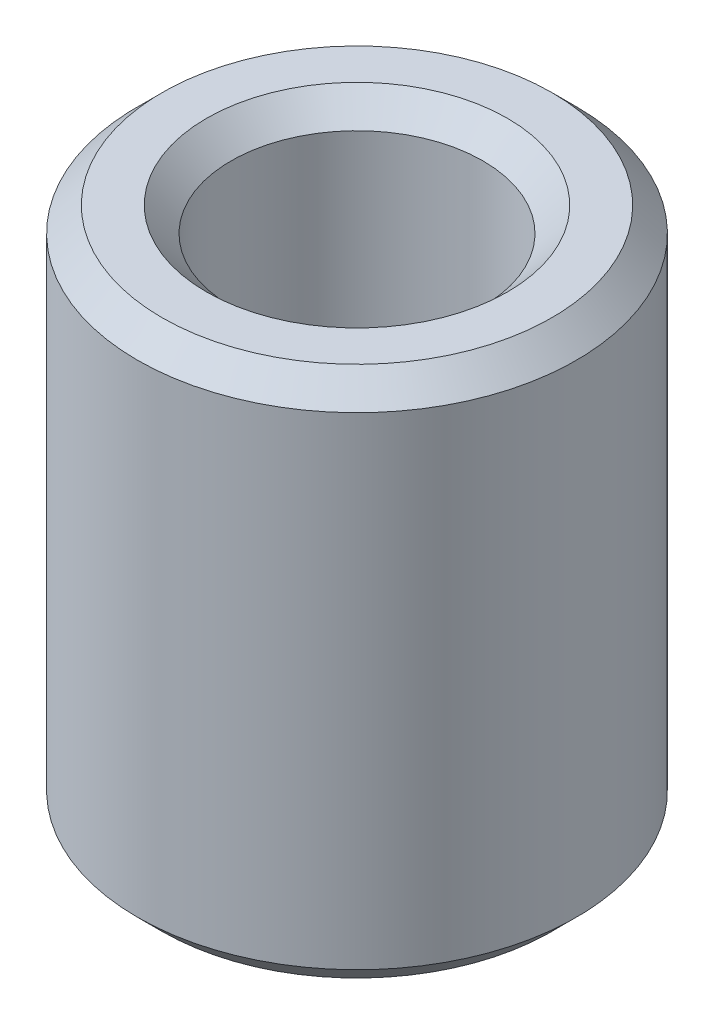
ISO-10303-21;
HEADER;
FILE_DESCRIPTION(('STEP AP214'),'2;1');
FILE_NAME('part.step','',(''),(''),'','','');
FILE_SCHEMA(('AUTOMOTIVE_DESIGN { 1 0 10303 214 1 1 1 1 }'));
ENDSEC;
DATA;
#1=APPLICATION_CONTEXT('core data for automotive mechanical design processes');
#2=APPLICATION_PROTOCOL_DEFINITION('international standard','automotive_design',2000,#1);
#3=PRODUCT_CONTEXT('',#1,'mechanical');
#4=PRODUCT('Part','Part','',(#3));
#5=PRODUCT_RELATED_PRODUCT_CATEGORY('part','',(#4));
#6=PRODUCT_DEFINITION_FORMATION('','',#4);
#7=PRODUCT_DEFINITION_CONTEXT('part definition',#1,'design');
#8=PRODUCT_DEFINITION('design','',#6,#7);
#9=PRODUCT_DEFINITION_SHAPE('','',#8);
#10=(LENGTH_UNIT() NAMED_UNIT(*) SI_UNIT(.MILLI.,.METRE.));
#11=(NAMED_UNIT(*) PLANE_ANGLE_UNIT() SI_UNIT($,.RADIAN.));
#12=(NAMED_UNIT(*) SI_UNIT($,.STERADIAN.) SOLID_ANGLE_UNIT());
#13=UNCERTAINTY_MEASURE_WITH_UNIT(LENGTH_MEASURE(1.E-05),#10,'distance_accuracy_value','');
#14=(GEOMETRIC_REPRESENTATION_CONTEXT(3) GLOBAL_UNCERTAINTY_ASSIGNED_CONTEXT((#13)) GLOBAL_UNIT_ASSIGNED_CONTEXT((#10,
#11,#12)) REPRESENTATION_CONTEXT('',''));
#15=CARTESIAN_POINT('',(0.,0.,0.));
#16=DIRECTION('',(0.,0.,1.));
#17=DIRECTION('',(1.,0.,0.));
#18=AXIS2_PLACEMENT_3D('',#15,#16,#17);
#19=CARTESIAN_POINT('',(0.,48.4298238941089,0.));
#20=DIRECTION('',(0.,-1.,0.));
#21=DIRECTION('',(0.,0.,-1.));
#22=AXIS2_PLACEMENT_3D('',#19,#20,#21);
#23=CYLINDRICAL_SURFACE('',#22,20.);
#24=CARTESIAN_POINT('',(0.,2.23736414351285,0.));
#25=DIRECTION('',(0.,1.,0.));
#26=DIRECTION('',(0.,0.,1.));
#27=AXIS2_PLACEMENT_3D('',#24,#25,#26);
#28=CIRCLE('',#27,20.);
#29=CARTESIAN_POINT('',(0.,2.23736414351285,-20.));
#30=VERTEX_POINT('',#29);
#31=EDGE_CURVE('E10',#30,#30,#28,.T.);
#32=CARTESIAN_POINT('',(0.,46.1924597505961,0.));
#33=DIRECTION('',(0.,1.,0.));
#34=DIRECTION('',(0.,0.,1.));
#35=AXIS2_PLACEMENT_3D('',#32,#33,#34);
#36=CIRCLE('',#35,20.);
#37=CARTESIAN_POINT('',(0.,46.1924597505961,-20.));
#38=VERTEX_POINT('',#37);
#39=EDGE_CURVE('E50',#38,#38,#36,.F.);
#40=CARTESIAN_POINT('',(0.,2.23736414351285,-20.));
#41=CARTESIAN_POINT('',(0.,2.6952297227533,-20.));
#42=CARTESIAN_POINT('',(0.,3.15309530199375,-20.));
#43=CARTESIAN_POINT('',(0.,4.06882646047465,-20.));
#44=CARTESIAN_POINT('',(0.,4.5266920397151,-20.));
#45=CARTESIAN_POINT('',(0.,5.442423198196,-20.));
#46=CARTESIAN_POINT('',(0.,5.90028877743645,-20.));
#47=CARTESIAN_POINT('',(0.,6.81601993591735,-20.));
#48=CARTESIAN_POINT('',(0.,7.2738855151578,-20.));
#49=CARTESIAN_POINT('',(0.,8.18961667363871,-20.));
#50=CARTESIAN_POINT('',(0.,8.64748225287916,-20.));
#51=CARTESIAN_POINT('',(0.,9.56321341136006,-20.));
#52=CARTESIAN_POINT('',(0.,10.0210789906005,-20.));
#53=CARTESIAN_POINT('',(0.,10.9368101490814,-20.));
#54=CARTESIAN_POINT('',(0.,11.3946757283219,-20.));
#55=CARTESIAN_POINT('',(0.,12.3104068868028,-20.));
#56=CARTESIAN_POINT('',(0.,12.7682724660432,-20.));
#57=CARTESIAN_POINT('',(0.,13.6840036245241,-20.));
#58=CARTESIAN_POINT('',(0.,14.1418692037646,-20.));
#59=CARTESIAN_POINT('',(0.,15.0576003622455,-20.));
#60=CARTESIAN_POINT('',(0.,15.5154659414859,-20.));
#61=CARTESIAN_POINT('',(0.,16.4311970999668,-20.));
#62=CARTESIAN_POINT('',(0.,16.8890626792073,-20.));
#63=CARTESIAN_POINT('',(0.,17.8047938376882,-20.));
#64=CARTESIAN_POINT('',(0.,18.2626594169286,-20.));
#65=CARTESIAN_POINT('',(0.,19.1783905754095,-20.));
#66=CARTESIAN_POINT('',(0.,19.63625615465,-20.));
#67=CARTESIAN_POINT('',(0.,20.5519873131309,-20.));
#68=CARTESIAN_POINT('',(0.,21.0098528923713,-20.));
#69=CARTESIAN_POINT('',(0.,21.9255840508522,-20.));
#70=CARTESIAN_POINT('',(0.,22.3834496300927,-20.));
#71=CARTESIAN_POINT('',(0.,23.2991807885736,-20.));
#72=CARTESIAN_POINT('',(0.,23.757046367814,-20.));
#73=CARTESIAN_POINT('',(0.,24.6727775262949,-20.));
#74=CARTESIAN_POINT('',(0.,25.1306431055354,-20.));
#75=CARTESIAN_POINT('',(0.,26.0463742640163,-20.));
#76=CARTESIAN_POINT('',(0.,26.5042398432567,-20.));
#77=CARTESIAN_POINT('',(0.,27.4199710017376,-20.));
#78=CARTESIAN_POINT('',(0.,27.8778365809781,-20.));
#79=CARTESIAN_POINT('',(0.,28.793567739459,-20.));
#80=CARTESIAN_POINT('',(0.,29.2514333186994,-20.));
#81=CARTESIAN_POINT('',(0.,30.1671644771803,-20.));
#82=CARTESIAN_POINT('',(0.,30.6250300564208,-20.));
#83=CARTESIAN_POINT('',(0.,31.5407612149017,-20.));
#84=CARTESIAN_POINT('',(0.,31.9986267941421,-20.));
#85=CARTESIAN_POINT('',(0.,32.914357952623,-20.));
#86=CARTESIAN_POINT('',(0.,33.3722235318635,-20.));
#87=CARTESIAN_POINT('',(0.,34.2879546903444,-20.));
#88=CARTESIAN_POINT('',(0.,34.7458202695848,-20.));
#89=CARTESIAN_POINT('',(0.,35.6615514280657,-20.));
#90=CARTESIAN_POINT('',(0.,36.1194170073062,-20.));
#91=CARTESIAN_POINT('',(0.,37.0351481657871,-20.));
#92=CARTESIAN_POINT('',(0.,37.4930137450275,-20.));
#93=CARTESIAN_POINT('',(0.,38.4087449035084,-20.));
#94=CARTESIAN_POINT('',(0.,38.8666104827489,-20.));
#95=CARTESIAN_POINT('',(0.,39.7823416412298,-20.));
#96=CARTESIAN_POINT('',(0.,40.2402072204702,-20.));
#97=CARTESIAN_POINT('',(0.,41.1559383789511,-20.));
#98=CARTESIAN_POINT('',(0.,41.6138039581916,-20.));
#99=CARTESIAN_POINT('',(0.,42.5295351166725,-20.));
#100=CARTESIAN_POINT('',(0.,42.9874006959129,-20.));
#101=CARTESIAN_POINT('',(0.,43.9031318543938,-20.));
#102=CARTESIAN_POINT('',(0.,44.3609974336343,-20.));
#103=CARTESIAN_POINT('',(0.,45.2767285921152,-20.));
#104=CARTESIAN_POINT('',(0.,45.7345941713556,-20.));
#105=CARTESIAN_POINT('',(0.,46.1924597505961,-20.));
#106=B_SPLINE_CURVE_WITH_KNOTS('',3,(#40,#41,#42,#43,#44,#45,#46,#47,#48,#49,#50,#51,#52,#53,
#54,#55,#56,#57,#58,#59,#60,#61,#62,#63,#64,#65,#66,#67,#68,#69,#70,#71,#72,#73,#74,#75,#76,#77,
#78,#79,#80,#81,#82,#83,#84,#85,#86,#87,#88,#89,#90,#91,#92,#93,#94,#95,#96,#97,#98,#99,#100,
#101,#102,#103,#104,#105),.UNSPECIFIED.,.F.,.F.,(4,2,2,2,2,2,2,2,2,2,2,2,2,2,2,2,2,2,2,2,2,2,2,
2,2,2,2,2,2,2,2,2,4),(0.,1.37359673772135,2.7471934754427,4.12079021316405,5.49438695088541,
6.86798368860676,8.24158042632811,9.61517716404946,10.9887739017708,12.3623706394922,
13.7359673772135,15.1095641149349,16.4831608526562,17.8567575903776,19.2303543280989,
20.6039510658203,21.9775478035416,23.351144541263,24.7247412789843,26.0983380167057,
27.471934754427,28.8455314921484,30.2191282298697,31.5927249675911,32.9663217053124,
34.3399184430338,35.7135151807551,37.0871119184765,38.4607086561978,39.8343053939192,
41.2079021316406,42.5814988693619,43.9550956070833),.UNSPECIFIED.);
#107=EDGE_CURVE('BSEAM39',#30,#38,#106,.T.);
#108=ORIENTED_EDGE('',*,*,#31,.T.);
#109=ORIENTED_EDGE('',*,*,#39,.T.);
#110=ORIENTED_EDGE('',*,*,#107,.T.);
#111=ORIENTED_EDGE('',*,*,#107,.F.);
#112=EDGE_LOOP('',(#108,#110,#109,#111));
#113=FACE_BOUND('',#112,.T.);
#114=ADVANCED_FACE('F39',(#113),#23,.T.);
#115=CARTESIAN_POINT('',(0.,48.4298238941089,0.));
#116=DIRECTION('',(0.,1.,0.));
#117=DIRECTION('',(0.,0.,1.));
#118=AXIS2_PLACEMENT_3D('',#115,#116,#117);
#119=PLANE('',#118);
#120=CARTESIAN_POINT('',(0.,48.4298238941089,0.));
#121=DIRECTION('',(0.,1.,0.));
#122=DIRECTION('',(0.,0.,1.));
#123=AXIS2_PLACEMENT_3D('',#120,#121,#122);
#124=CIRCLE('',#123,13.7087048069817);
#125=CARTESIAN_POINT('',(0.,48.4298238941089,13.7087048069817));
#126=VERTEX_POINT('',#125);
#127=EDGE_CURVE('E58',#126,#126,#124,.F.);
#128=ORIENTED_EDGE('',*,*,#127,.T.);
#129=EDGE_LOOP('',(#128));
#130=FACE_BOUND('',#129,.T.);
#131=CARTESIAN_POINT('',(0.,48.4298238941089,0.));
#132=DIRECTION('',(0.,1.,0.));
#133=DIRECTION('',(0.,0.,1.));
#134=AXIS2_PLACEMENT_3D('',#131,#132,#133);
#135=CIRCLE('',#134,17.7626358564873);
#136=CARTESIAN_POINT('',(0.,48.4298238941089,17.7626358564873));
#137=VERTEX_POINT('',#136);
#138=EDGE_CURVE('E61',#137,#137,#135,.T.);
#139=ORIENTED_EDGE('',*,*,#138,.T.);
#140=EDGE_LOOP('',(#139));
#141=FACE_BOUND('',#140,.T.);
#142=ADVANCED_FACE('F88',(#130,#141),#119,.T.);
#143=CARTESIAN_POINT('',(0.,0.,0.));
#144=DIRECTION('',(0.,1.,0.));
#145=DIRECTION('',(0.,0.,1.));
#146=AXIS2_PLACEMENT_3D('',#143,#144,#145);
#147=PLANE('',#146);
#148=CARTESIAN_POINT('',(0.,0.,0.));
#149=DIRECTION('',(0.,1.,0.));
#150=DIRECTION('',(0.,0.,1.));
#151=AXIS2_PLACEMENT_3D('',#148,#149,#150);
#152=CIRCLE('',#151,13.7087048069817);
#153=CARTESIAN_POINT('',(0.,0.,13.7087048069817));
#154=VERTEX_POINT('',#153);
#155=EDGE_CURVE('E51',#154,#154,#152,.T.);
#156=ORIENTED_EDGE('',*,*,#155,.T.);
#157=EDGE_LOOP('',(#156));
#158=FACE_BOUND('',#157,.T.);
#159=CARTESIAN_POINT('',(0.,0.,0.));
#160=DIRECTION('',(0.,1.,0.));
#161=DIRECTION('',(0.,0.,1.));
#162=AXIS2_PLACEMENT_3D('',#159,#160,#161);
#163=CIRCLE('',#162,17.7626358564871);
#164=CARTESIAN_POINT('',(0.,0.,17.7626358564871));
#165=VERTEX_POINT('',#164);
#166=EDGE_CURVE('E54',#165,#165,#163,.F.);
#167=ORIENTED_EDGE('',*,*,#166,.T.);
#168=EDGE_LOOP('',(#167));
#169=FACE_BOUND('',#168,.T.);
#170=ADVANCED_FACE('F83',(#158,#169),#147,.F.);
#171=CARTESIAN_POINT('',(0.,48.4298238941089,0.));
#172=DIRECTION('',(0.,-1.,0.));
#173=DIRECTION('',(0.,0.,-1.));
#174=AXIS2_PLACEMENT_3D('',#171,#172,#173);
#175=CYLINDRICAL_SURFACE('',#174,11.4713406634689);
#176=CARTESIAN_POINT('',(0.,46.192459750596,0.));
#177=DIRECTION('',(0.,1.,0.));
#178=DIRECTION('',(0.,0.,1.));
#179=AXIS2_PLACEMENT_3D('',#176,#177,#178);
#180=CIRCLE('',#179,11.4713406634689);
#181=CARTESIAN_POINT('',(0.,46.192459750596,-11.4713406634689));
#182=VERTEX_POINT('',#181);
#183=EDGE_CURVE('E67',#182,#182,#180,.T.);
#184=CARTESIAN_POINT('',(0.,2.2373641435128,0.));
#185=DIRECTION('',(0.,1.,0.));
#186=DIRECTION('',(0.,0.,1.));
#187=AXIS2_PLACEMENT_3D('',#184,#185,#186);
#188=CIRCLE('',#187,11.4713406634689);
#189=CARTESIAN_POINT('',(0.,2.23736414351279,-11.4713406634689));
#190=VERTEX_POINT('',#189);
#191=EDGE_CURVE('E69',#190,#190,#188,.F.);
#192=CARTESIAN_POINT('',(0.,46.192459750596,-11.4713406634689));
#193=CARTESIAN_POINT('',(0.,45.7345941713556,-11.4713406634689));
#194=CARTESIAN_POINT('',(0.,45.2767285921151,-11.4713406634689));
#195=CARTESIAN_POINT('',(0.,44.3609974336342,-11.4713406634689));
#196=CARTESIAN_POINT('',(0.,43.9031318543938,-11.4713406634689));
#197=CARTESIAN_POINT('',(0.,42.9874006959129,-11.4713406634689));
#198=CARTESIAN_POINT('',(0.,42.5295351166724,-11.4713406634689));
#199=CARTESIAN_POINT('',(0.,41.6138039581915,-11.4713406634689));
#200=CARTESIAN_POINT('',(0.,41.1559383789511,-11.4713406634689));
#201=CARTESIAN_POINT('',(0.,40.2402072204702,-11.4713406634689));
#202=CARTESIAN_POINT('',(0.,39.7823416412297,-11.4713406634689));
#203=CARTESIAN_POINT('',(0.,38.8666104827488,-11.4713406634689));
#204=CARTESIAN_POINT('',(0.,38.4087449035084,-11.4713406634689));
#205=CARTESIAN_POINT('',(0.,37.4930137450275,-11.4713406634689));
#206=CARTESIAN_POINT('',(0.,37.035148165787,-11.4713406634689));
#207=CARTESIAN_POINT('',(0.,36.1194170073061,-11.4713406634689));
#208=CARTESIAN_POINT('',(0.,35.6615514280657,-11.4713406634689));
#209=CARTESIAN_POINT('',(0.,34.7458202695848,-11.4713406634689));
#210=CARTESIAN_POINT('',(0.,34.2879546903443,-11.4713406634689));
#211=CARTESIAN_POINT('',(0.,33.3722235318634,-11.4713406634689));
#212=CARTESIAN_POINT('',(0.,32.914357952623,-11.4713406634689));
#213=CARTESIAN_POINT('',(0.,31.9986267941421,-11.4713406634689));
#214=CARTESIAN_POINT('',(0.,31.5407612149016,-11.4713406634689));
#215=CARTESIAN_POINT('',(0.,30.6250300564207,-11.4713406634689));
#216=CARTESIAN_POINT('',(0.,30.1671644771803,-11.4713406634689));
#217=CARTESIAN_POINT('',(0.,29.2514333186994,-11.4713406634689));
#218=CARTESIAN_POINT('',(0.,28.7935677394589,-11.4713406634689));
#219=CARTESIAN_POINT('',(0.,27.877836580978,-11.4713406634689));
#220=CARTESIAN_POINT('',(0.,27.4199710017376,-11.4713406634689));
#221=CARTESIAN_POINT('',(0.,26.5042398432567,-11.4713406634689));
#222=CARTESIAN_POINT('',(0.,26.0463742640162,-11.4713406634689));
#223=CARTESIAN_POINT('',(0.,25.1306431055353,-11.4713406634689));
#224=CARTESIAN_POINT('',(0.,24.6727775262949,-11.4713406634689));
#225=CARTESIAN_POINT('',(0.,23.757046367814,-11.4713406634689));
#226=CARTESIAN_POINT('',(0.,23.2991807885735,-11.4713406634689));
#227=CARTESIAN_POINT('',(0.,22.3834496300926,-11.4713406634689));
#228=CARTESIAN_POINT('',(0.,21.9255840508522,-11.4713406634689));
#229=CARTESIAN_POINT('',(0.,21.0098528923713,-11.4713406634689));
#230=CARTESIAN_POINT('',(0.,20.5519873131308,-11.4713406634689));
#231=CARTESIAN_POINT('',(0.,19.6362561546499,-11.4713406634689));
#232=CARTESIAN_POINT('',(0.,19.1783905754095,-11.4713406634689));
#233=CARTESIAN_POINT('',(0.,18.2626594169286,-11.4713406634689));
#234=CARTESIAN_POINT('',(0.,17.8047938376881,-11.4713406634689));
#235=CARTESIAN_POINT('',(0.,16.8890626792072,-11.4713406634689));
#236=CARTESIAN_POINT('',(0.,16.4311970999668,-11.4713406634689));
#237=CARTESIAN_POINT('',(0.,15.5154659414859,-11.4713406634689));
#238=CARTESIAN_POINT('',(0.,15.0576003622454,-11.4713406634689));
#239=CARTESIAN_POINT('',(0.,14.1418692037645,-11.4713406634689));
#240=CARTESIAN_POINT('',(0.,13.6840036245241,-11.4713406634689));
#241=CARTESIAN_POINT('',(0.,12.7682724660432,-11.4713406634689));
#242=CARTESIAN_POINT('',(0.,12.3104068868027,-11.4713406634689));
#243=CARTESIAN_POINT('',(0.,11.3946757283218,-11.4713406634689));
#244=CARTESIAN_POINT('',(0.,10.9368101490813,-11.4713406634689));
#245=CARTESIAN_POINT('',(0.,10.0210789906004,-11.4713406634689));
#246=CARTESIAN_POINT('',(0.,9.56321341135999,-11.4713406634689));
#247=CARTESIAN_POINT('',(0.,8.64748225287909,-11.4713406634689));
#248=CARTESIAN_POINT('',(0.,8.18961667363864,-11.4713406634689));
#249=CARTESIAN_POINT('',(0.,7.27388551515774,-11.4713406634689));
#250=CARTESIAN_POINT('',(0.,6.81601993591729,-11.4713406634689));
#251=CARTESIAN_POINT('',(0.,5.90028877743639,-11.4713406634689));
#252=CARTESIAN_POINT('',(0.,5.44242319819594,-11.4713406634689));
#253=CARTESIAN_POINT('',(0.,4.52669203971504,-11.4713406634689));
#254=CARTESIAN_POINT('',(0.,4.06882646047459,-11.4713406634689));
#255=CARTESIAN_POINT('',(0.,3.15309530199369,-11.4713406634689));
#256=CARTESIAN_POINT('',(0.,2.69522972275324,-11.4713406634689));
#257=CARTESIAN_POINT('',(0.,2.23736414351279,-11.4713406634689));
#258=B_SPLINE_CURVE_WITH_KNOTS('',3,(#192,#193,#194,#195,#196,#197,#198,#199,#200,#201,#202,
#203,#204,#205,#206,#207,#208,#209,#210,#211,#212,#213,#214,#215,#216,#217,#218,#219,#220,#221,
#222,#223,#224,#225,#226,#227,#228,#229,#230,#231,#232,#233,#234,#235,#236,#237,#238,#239,#240,
#241,#242,#243,#244,#245,#246,#247,#248,#249,#250,#251,#252,#253,#254,#255,#256,#257),
.UNSPECIFIED.,.F.,.F.,(4,2,2,2,2,2,2,2,2,2,2,2,2,2,2,2,2,2,2,2,2,2,2,2,2,2,2,2,2,2,2,2,4),(0.,
1.37359673772135,2.74719347544271,4.12079021316405,5.49438695088541,6.86798368860676,
8.24158042632811,9.61517716404946,10.9887739017708,12.3623706394922,13.7359673772135,
15.1095641149349,16.4831608526562,17.8567575903776,19.2303543280989,20.6039510658203,
21.9775478035416,23.351144541263,24.7247412789843,26.0983380167057,27.471934754427,
28.8455314921484,30.2191282298697,31.5927249675911,32.9663217053124,34.3399184430338,
35.7135151807551,37.0871119184765,38.4607086561979,39.8343053939192,41.2079021316406,
42.5814988693619,43.9550956070833),.UNSPECIFIED.);
#259=EDGE_CURVE('BSEAM71',#182,#190,#258,.T.);
#260=ORIENTED_EDGE('',*,*,#183,.T.);
#261=ORIENTED_EDGE('',*,*,#191,.T.);
#262=ORIENTED_EDGE('',*,*,#259,.T.);
#263=ORIENTED_EDGE('',*,*,#259,.F.);
#264=EDGE_LOOP('',(#260,#262,#261,#263));
#265=FACE_BOUND('',#264,.T.);
#266=ADVANCED_FACE('F71',(#265),#175,.F.);
#267=CARTESIAN_POINT('',(0.,46.192459750596,0.));
#268=DIRECTION('',(0.,1.,0.));
#269=DIRECTION('',(0.,0.,1.));
#270=AXIS2_PLACEMENT_3D('',#267,#268,#269);
#271=CONICAL_SURFACE('',#270,11.4713406634689,0.785398163397452);
#272=ORIENTED_EDGE('',*,*,#127,.F.);
#273=EDGE_LOOP('',(#272));
#274=FACE_BOUND('',#273,.T.);
#275=ORIENTED_EDGE('',*,*,#183,.F.);
#276=EDGE_LOOP('',(#275));
#277=FACE_BOUND('',#276,.T.);
#278=ADVANCED_FACE('F77',(#274,#277),#271,.F.);
#279=CARTESIAN_POINT('',(0.,0.,0.));
#280=DIRECTION('',(0.,-1.,0.));
#281=DIRECTION('',(0.,0.,-1.));
#282=AXIS2_PLACEMENT_3D('',#279,#280,#281);
#283=CONICAL_SURFACE('',#282,13.7087048069817,0.785398163397445);
#284=ORIENTED_EDGE('',*,*,#191,.F.);
#285=EDGE_LOOP('',(#284));
#286=FACE_BOUND('',#285,.T.);
#287=ORIENTED_EDGE('',*,*,#155,.F.);
#288=EDGE_LOOP('',(#287));
#289=FACE_BOUND('',#288,.T.);
#290=ADVANCED_FACE('F73',(#286,#289),#283,.F.);
#291=CARTESIAN_POINT('',(0.,2.23736414351285,0.));
#292=DIRECTION('',(0.,1.,0.));
#293=DIRECTION('',(0.,0.,1.));
#294=AXIS2_PLACEMENT_3D('',#291,#292,#293);
#295=CONICAL_SURFACE('',#294,20.,0.785398163397453);
#296=ORIENTED_EDGE('',*,*,#166,.F.);
#297=EDGE_LOOP('',(#296));
#298=FACE_BOUND('',#297,.T.);
#299=ORIENTED_EDGE('',*,*,#31,.F.);
#300=EDGE_LOOP('',(#299));
#301=FACE_BOUND('',#300,.T.);
#302=ADVANCED_FACE('F76',(#298,#301),#295,.T.);
#303=CARTESIAN_POINT('',(0.,48.4298238941089,0.));
#304=DIRECTION('',(0.,-1.,0.));
#305=DIRECTION('',(0.,0.,-1.));
#306=AXIS2_PLACEMENT_3D('',#303,#304,#305);
#307=CONICAL_SURFACE('',#306,17.7626358564873,0.785398163397444);
#308=ORIENTED_EDGE('',*,*,#39,.F.);
#309=EDGE_LOOP('',(#308));
#310=FACE_BOUND('',#309,.T.);
#311=ORIENTED_EDGE('',*,*,#138,.F.);
#312=EDGE_LOOP('',(#311));
#313=FACE_BOUND('',#312,.T.);
#314=ADVANCED_FACE('F45',(#310,#313),#307,.T.);
#315=CLOSED_SHELL('',(#114,#142,#170,#266,#278,#290,#302,#314));
#316=MANIFOLD_SOLID_BREP('B2',#315);
#317=ADVANCED_BREP_SHAPE_REPRESENTATION('',(#18,#316),#14);
#318=SHAPE_DEFINITION_REPRESENTATION(#9,#317);
ENDSEC;
END-ISO-10303-21;
